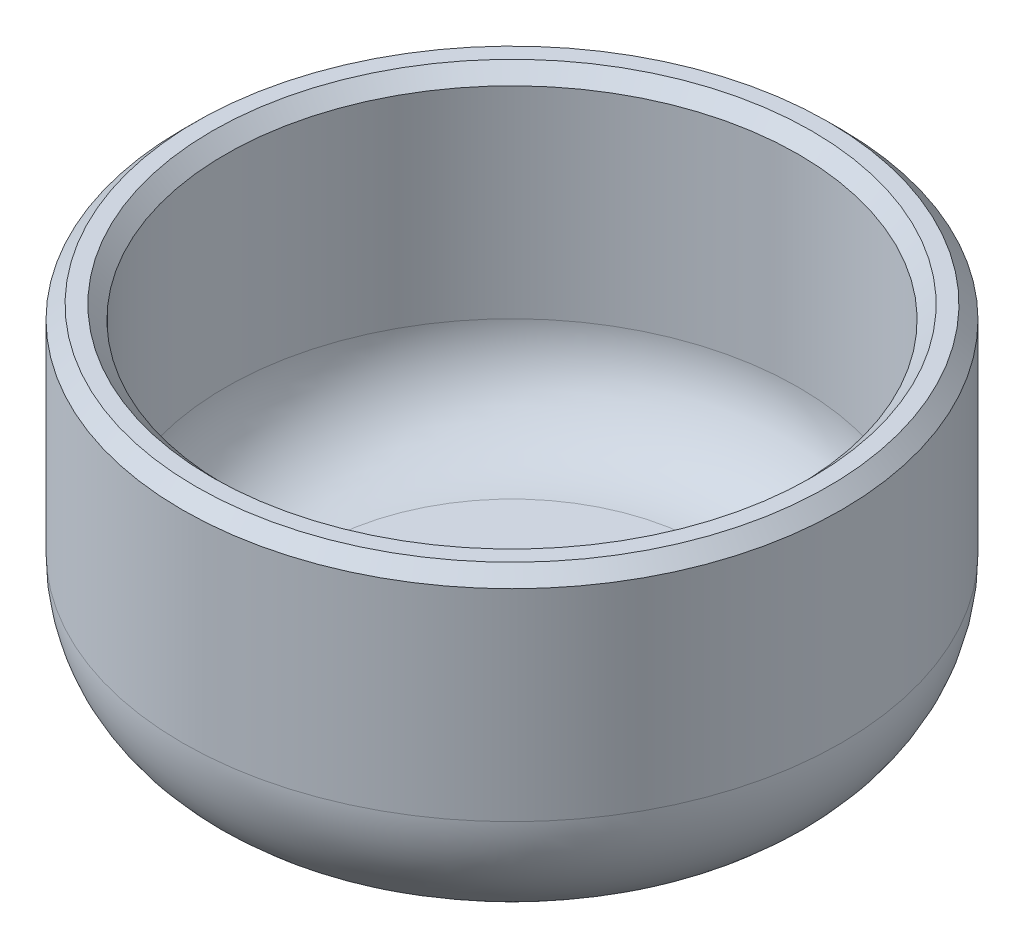
ISO-10303-21;
HEADER;
FILE_DESCRIPTION(('STEP AP214'),'2;1');
FILE_NAME('part.step','',(''),(''),'','','');
FILE_SCHEMA(('AUTOMOTIVE_DESIGN { 1 0 10303 214 1 1 1 1 }'));
ENDSEC;
DATA;
#1=APPLICATION_CONTEXT('core data for automotive mechanical design processes');
#2=APPLICATION_PROTOCOL_DEFINITION('international standard','automotive_design',2000,#1);
#3=PRODUCT_CONTEXT('',#1,'mechanical');
#4=PRODUCT('Part','Part','',(#3));
#5=PRODUCT_RELATED_PRODUCT_CATEGORY('part','',(#4));
#6=PRODUCT_DEFINITION_FORMATION('','',#4);
#7=PRODUCT_DEFINITION_CONTEXT('part definition',#1,'design');
#8=PRODUCT_DEFINITION('design','',#6,#7);
#9=PRODUCT_DEFINITION_SHAPE('','',#8);
#10=(LENGTH_UNIT() NAMED_UNIT(*) SI_UNIT(.MILLI.,.METRE.));
#11=(NAMED_UNIT(*) PLANE_ANGLE_UNIT() SI_UNIT($,.RADIAN.));
#12=(NAMED_UNIT(*) SI_UNIT($,.STERADIAN.) SOLID_ANGLE_UNIT());
#13=UNCERTAINTY_MEASURE_WITH_UNIT(LENGTH_MEASURE(1.E-05),#10,'distance_accuracy_value','');
#14=(GEOMETRIC_REPRESENTATION_CONTEXT(3) GLOBAL_UNCERTAINTY_ASSIGNED_CONTEXT((#13)) GLOBAL_UNIT_ASSIGNED_CONTEXT((#10,
#11,#12)) REPRESENTATION_CONTEXT('',''));
#15=CARTESIAN_POINT('',(0.,0.,0.));
#16=DIRECTION('',(0.,0.,1.));
#17=DIRECTION('',(1.,0.,0.));
#18=AXIS2_PLACEMENT_3D('',#15,#16,#17);
#19=CARTESIAN_POINT('',(0.,13.,0.));
#20=DIRECTION('',(0.,-1.,0.));
#21=DIRECTION('',(0.,0.,-1.));
#22=AXIS2_PLACEMENT_3D('',#19,#20,#21);
#23=CYLINDRICAL_SURFACE('',#22,12.25);
#24=CARTESIAN_POINT('',(0.,12.5,0.));
#25=DIRECTION('',(0.,1.,0.));
#26=DIRECTION('',(0.,0.,1.));
#27=AXIS2_PLACEMENT_3D('',#24,#25,#26);
#28=CIRCLE('',#27,12.25);
#29=CARTESIAN_POINT('',(0.,12.5,-12.25));
#30=VERTEX_POINT('',#29);
#31=EDGE_CURVE('E38',#30,#30,#28,.F.);
#32=CARTESIAN_POINT('',(0.,5.,0.));
#33=DIRECTION('',(0.,1.,0.));
#34=DIRECTION('',(0.,0.,1.));
#35=AXIS2_PLACEMENT_3D('',#32,#33,#34);
#36=CIRCLE('',#35,12.25);
#37=CARTESIAN_POINT('',(0.,4.99999999999999,-12.25));
#38=VERTEX_POINT('',#37);
#39=EDGE_CURVE('E54',#38,#38,#36,.T.);
#40=CARTESIAN_POINT('',(0.,12.5,-12.25));
#41=CARTESIAN_POINT('',(0.,12.421875,-12.25));
#42=CARTESIAN_POINT('',(0.,12.34375,-12.25));
#43=CARTESIAN_POINT('',(0.,12.1875,-12.25));
#44=CARTESIAN_POINT('',(0.,12.109375,-12.25));
#45=CARTESIAN_POINT('',(0.,11.953125,-12.25));
#46=CARTESIAN_POINT('',(0.,11.875,-12.25));
#47=CARTESIAN_POINT('',(0.,11.71875,-12.25));
#48=CARTESIAN_POINT('',(0.,11.640625,-12.25));
#49=CARTESIAN_POINT('',(0.,11.484375,-12.25));
#50=CARTESIAN_POINT('',(0.,11.40625,-12.25));
#51=CARTESIAN_POINT('',(0.,11.25,-12.25));
#52=CARTESIAN_POINT('',(0.,11.171875,-12.25));
#53=CARTESIAN_POINT('',(0.,11.015625,-12.25));
#54=CARTESIAN_POINT('',(0.,10.9375,-12.25));
#55=CARTESIAN_POINT('',(0.,10.78125,-12.25));
#56=CARTESIAN_POINT('',(0.,10.703125,-12.25));
#57=CARTESIAN_POINT('',(0.,10.546875,-12.25));
#58=CARTESIAN_POINT('',(0.,10.46875,-12.25));
#59=CARTESIAN_POINT('',(0.,10.3125,-12.25));
#60=CARTESIAN_POINT('',(0.,10.234375,-12.25));
#61=CARTESIAN_POINT('',(0.,10.078125,-12.25));
#62=CARTESIAN_POINT('',(0.,10.,-12.25));
#63=CARTESIAN_POINT('',(0.,9.84375000000001,-12.25));
#64=CARTESIAN_POINT('',(0.,9.76562500000001,-12.25));
#65=CARTESIAN_POINT('',(0.,9.60937500000001,-12.25));
#66=CARTESIAN_POINT('',(0.,9.53125000000001,-12.25));
#67=CARTESIAN_POINT('',(0.,9.37500000000001,-12.25));
#68=CARTESIAN_POINT('',(0.,9.29687500000001,-12.25));
#69=CARTESIAN_POINT('',(0.,9.14062500000001,-12.25));
#70=CARTESIAN_POINT('',(0.,9.06250000000001,-12.25));
#71=CARTESIAN_POINT('',(0.,8.90625000000001,-12.25));
#72=CARTESIAN_POINT('',(0.,8.828125,-12.25));
#73=CARTESIAN_POINT('',(0.,8.671875,-12.25));
#74=CARTESIAN_POINT('',(0.,8.59375000000001,-12.25));
#75=CARTESIAN_POINT('',(0.,8.43750000000001,-12.25));
#76=CARTESIAN_POINT('',(0.,8.359375,-12.25));
#77=CARTESIAN_POINT('',(0.,8.203125,-12.25));
#78=CARTESIAN_POINT('',(0.,8.125,-12.25));
#79=CARTESIAN_POINT('',(0.,7.96875,-12.25));
#80=CARTESIAN_POINT('',(0.,7.890625,-12.25));
#81=CARTESIAN_POINT('',(0.,7.734375,-12.25));
#82=CARTESIAN_POINT('',(0.,7.65625,-12.25));
#83=CARTESIAN_POINT('',(0.,7.5,-12.25));
#84=CARTESIAN_POINT('',(0.,7.421875,-12.25));
#85=CARTESIAN_POINT('',(0.,7.265625,-12.25));
#86=CARTESIAN_POINT('',(0.,7.1875,-12.25));
#87=CARTESIAN_POINT('',(0.,7.03125,-12.25));
#88=CARTESIAN_POINT('',(0.,6.953125,-12.25));
#89=CARTESIAN_POINT('',(0.,6.796875,-12.25));
#90=CARTESIAN_POINT('',(0.,6.71875,-12.25));
#91=CARTESIAN_POINT('',(0.,6.5625,-12.25));
#92=CARTESIAN_POINT('',(0.,6.484375,-12.25));
#93=CARTESIAN_POINT('',(0.,6.328125,-12.25));
#94=CARTESIAN_POINT('',(0.,6.25,-12.25));
#95=CARTESIAN_POINT('',(0.,6.09375,-12.25));
#96=CARTESIAN_POINT('',(0.,6.015625,-12.25));
#97=CARTESIAN_POINT('',(0.,5.859375,-12.25));
#98=CARTESIAN_POINT('',(0.,5.78125,-12.25));
#99=CARTESIAN_POINT('',(0.,5.625,-12.25));
#100=CARTESIAN_POINT('',(0.,5.54687499999999,-12.25));
#101=CARTESIAN_POINT('',(0.,5.39062499999999,-12.25));
#102=CARTESIAN_POINT('',(0.,5.31249999999999,-12.25));
#103=CARTESIAN_POINT('',(0.,5.15624999999999,-12.25));
#104=CARTESIAN_POINT('',(0.,5.07812499999999,-12.25));
#105=CARTESIAN_POINT('',(0.,4.99999999999999,-12.25));
#106=B_SPLINE_CURVE_WITH_KNOTS('',3,(#40,#41,#42,#43,#44,#45,#46,#47,#48,#49,#50,#51,#52,#53,
#54,#55,#56,#57,#58,#59,#60,#61,#62,#63,#64,#65,#66,#67,#68,#69,#70,#71,#72,#73,#74,#75,#76,#77,
#78,#79,#80,#81,#82,#83,#84,#85,#86,#87,#88,#89,#90,#91,#92,#93,#94,#95,#96,#97,#98,#99,#100,
#101,#102,#103,#104,#105),.UNSPECIFIED.,.F.,.F.,(4,2,2,2,2,2,2,2,2,2,2,2,2,2,2,2,2,2,2,2,2,2,2,
2,2,2,2,2,2,2,2,2,4),(0.,0.234375,0.46875,0.703125000000001,0.937500000000003,1.171875,1.40625,
1.640625,1.87500000000001,2.10937500000001,2.34375000000001,2.57812500000001,2.81250000000001,
3.04687500000001,3.28125000000001,3.51562500000001,3.75000000000001,3.98437500000001,
4.21875000000001,4.45312500000001,4.68750000000001,4.92187500000002,5.15625000000002,
5.39062500000002,5.62500000000002,5.85937500000002,6.09375000000002,6.32812500000002,
6.56250000000002,6.79687500000002,7.03125000000002,7.26562500000002,7.50000000000002),.UNSPECIFIED.);
#107=EDGE_CURVE('BSEAM31',#30,#38,#106,.T.);
#108=ORIENTED_EDGE('',*,*,#31,.T.);
#109=ORIENTED_EDGE('',*,*,#39,.T.);
#110=ORIENTED_EDGE('',*,*,#107,.T.);
#111=ORIENTED_EDGE('',*,*,#107,.F.);
#112=EDGE_LOOP('',(#108,#110,#109,#111));
#113=FACE_BOUND('',#112,.T.);
#114=ADVANCED_FACE('F31',(#113),#23,.T.);
#115=CARTESIAN_POINT('',(0.,13.,0.));
#116=DIRECTION('',(0.,1.,0.));
#117=DIRECTION('',(0.,0.,1.));
#118=AXIS2_PLACEMENT_3D('',#115,#116,#117);
#119=PLANE('',#118);
#120=CARTESIAN_POINT('',(0.,13.,0.));
#121=DIRECTION('',(0.,1.,0.));
#122=DIRECTION('',(0.,0.,1.));
#123=AXIS2_PLACEMENT_3D('',#120,#121,#122);
#124=CIRCLE('',#123,11.75);
#125=CARTESIAN_POINT('',(0.,13.,11.75));
#126=VERTEX_POINT('',#125);
#127=EDGE_CURVE('E42',#126,#126,#124,.T.);
#128=ORIENTED_EDGE('',*,*,#127,.T.);
#129=EDGE_LOOP('',(#128));
#130=FACE_BOUND('',#129,.T.);
#131=CARTESIAN_POINT('',(0.,13.,0.));
#132=DIRECTION('',(0.,1.,0.));
#133=DIRECTION('',(0.,0.,1.));
#134=AXIS2_PLACEMENT_3D('',#131,#132,#133);
#135=CIRCLE('',#134,11.15);
#136=CARTESIAN_POINT('',(0.,13.,11.15));
#137=VERTEX_POINT('',#136);
#138=EDGE_CURVE('E46',#137,#137,#135,.F.);
#139=ORIENTED_EDGE('',*,*,#138,.T.);
#140=EDGE_LOOP('',(#139));
#141=FACE_BOUND('',#140,.T.);
#142=ADVANCED_FACE('F81',(#130,#141),#119,.T.);
#143=CARTESIAN_POINT('',(0.,0.,0.));
#144=DIRECTION('',(0.,1.,0.));
#145=DIRECTION('',(0.,0.,1.));
#146=AXIS2_PLACEMENT_3D('',#143,#144,#145);
#147=PLANE('',#146);
#148=CARTESIAN_POINT('',(0.,0.,0.));
#149=DIRECTION('',(0.,1.,0.));
#150=DIRECTION('',(0.,0.,1.));
#151=AXIS2_PLACEMENT_3D('',#148,#149,#150);
#152=CIRCLE('',#151,7.25);
#153=CARTESIAN_POINT('',(0.,0.,7.25));
#154=VERTEX_POINT('',#153);
#155=EDGE_CURVE('E51',#154,#154,#152,.F.);
#156=ORIENTED_EDGE('',*,*,#155,.T.);
#157=EDGE_LOOP('',(#156));
#158=FACE_BOUND('',#157,.T.);
#159=ADVANCED_FACE('F77',(#158),#147,.F.);
#160=CARTESIAN_POINT('',(0.,5.,0.));
#161=DIRECTION('',(0.,1.,0.));
#162=DIRECTION('',(0.,0.,1.));
#163=AXIS2_PLACEMENT_3D('',#160,#161,#162);
#164=TOROIDAL_SURFACE('',#163,7.25,5.);
#165=ORIENTED_EDGE('',*,*,#155,.F.);
#166=EDGE_LOOP('',(#165));
#167=FACE_BOUND('',#166,.T.);
#168=ORIENTED_EDGE('',*,*,#39,.F.);
#169=EDGE_LOOP('',(#168));
#170=FACE_BOUND('',#169,.T.);
#171=ADVANCED_FACE('F69',(#167,#170),#164,.T.);
#172=CARTESIAN_POINT('',(0.,13.,0.));
#173=DIRECTION('',(0.,-1.,0.));
#174=DIRECTION('',(0.,0.,-1.));
#175=AXIS2_PLACEMENT_3D('',#172,#173,#174);
#176=CYLINDRICAL_SURFACE('',#175,10.65);
#177=CARTESIAN_POINT('',(0.,12.5,0.));
#178=DIRECTION('',(0.,1.,0.));
#179=DIRECTION('',(0.,0.,1.));
#180=AXIS2_PLACEMENT_3D('',#177,#178,#179);
#181=CIRCLE('',#180,10.65);
#182=CARTESIAN_POINT('',(0.,12.5,-10.65));
#183=VERTEX_POINT('',#182);
#184=EDGE_CURVE('E10',#183,#183,#181,.T.);
#185=CARTESIAN_POINT('',(0.,5.,0.));
#186=DIRECTION('',(0.,-1.,0.));
#187=DIRECTION('',(0.,0.,-1.));
#188=AXIS2_PLACEMENT_3D('',#185,#186,#187);
#189=CIRCLE('',#188,10.65);
#190=CARTESIAN_POINT('',(0.,5.,-10.65));
#191=VERTEX_POINT('',#190);
#192=EDGE_CURVE('E60',#191,#191,#189,.F.);
#193=CARTESIAN_POINT('',(0.,12.5,-10.65));
#194=CARTESIAN_POINT('',(0.,12.421875,-10.65));
#195=CARTESIAN_POINT('',(0.,12.34375,-10.65));
#196=CARTESIAN_POINT('',(0.,12.1875,-10.65));
#197=CARTESIAN_POINT('',(0.,12.109375,-10.65));
#198=CARTESIAN_POINT('',(0.,11.953125,-10.65));
#199=CARTESIAN_POINT('',(0.,11.875,-10.65));
#200=CARTESIAN_POINT('',(0.,11.71875,-10.65));
#201=CARTESIAN_POINT('',(0.,11.640625,-10.65));
#202=CARTESIAN_POINT('',(0.,11.484375,-10.65));
#203=CARTESIAN_POINT('',(0.,11.40625,-10.65));
#204=CARTESIAN_POINT('',(0.,11.25,-10.65));
#205=CARTESIAN_POINT('',(0.,11.171875,-10.65));
#206=CARTESIAN_POINT('',(0.,11.015625,-10.65));
#207=CARTESIAN_POINT('',(0.,10.9375,-10.65));
#208=CARTESIAN_POINT('',(0.,10.78125,-10.65));
#209=CARTESIAN_POINT('',(0.,10.703125,-10.65));
#210=CARTESIAN_POINT('',(0.,10.546875,-10.65));
#211=CARTESIAN_POINT('',(0.,10.46875,-10.65));
#212=CARTESIAN_POINT('',(0.,10.3125,-10.65));
#213=CARTESIAN_POINT('',(0.,10.234375,-10.65));
#214=CARTESIAN_POINT('',(0.,10.078125,-10.65));
#215=CARTESIAN_POINT('',(0.,9.99999999999999,-10.65));
#216=CARTESIAN_POINT('',(0.,9.84374999999999,-10.65));
#217=CARTESIAN_POINT('',(0.,9.76562499999999,-10.65));
#218=CARTESIAN_POINT('',(0.,9.60937499999999,-10.65));
#219=CARTESIAN_POINT('',(0.,9.53124999999999,-10.65));
#220=CARTESIAN_POINT('',(0.,9.37499999999999,-10.65));
#221=CARTESIAN_POINT('',(0.,9.29687499999999,-10.65));
#222=CARTESIAN_POINT('',(0.,9.14062499999999,-10.65));
#223=CARTESIAN_POINT('',(0.,9.06249999999999,-10.65));
#224=CARTESIAN_POINT('',(0.,8.90624999999999,-10.65));
#225=CARTESIAN_POINT('',(0.,8.82812499999999,-10.65));
#226=CARTESIAN_POINT('',(0.,8.67187499999999,-10.65));
#227=CARTESIAN_POINT('',(0.,8.59374999999999,-10.65));
#228=CARTESIAN_POINT('',(0.,8.43749999999999,-10.65));
#229=CARTESIAN_POINT('',(0.,8.35937499999999,-10.65));
#230=CARTESIAN_POINT('',(0.,8.20312499999999,-10.65));
#231=CARTESIAN_POINT('',(0.,8.12499999999999,-10.65));
#232=CARTESIAN_POINT('',(0.,7.96874999999999,-10.65));
#233=CARTESIAN_POINT('',(0.,7.89062499999999,-10.65));
#234=CARTESIAN_POINT('',(0.,7.73437499999999,-10.65));
#235=CARTESIAN_POINT('',(0.,7.65624999999999,-10.65));
#236=CARTESIAN_POINT('',(0.,7.49999999999999,-10.65));
#237=CARTESIAN_POINT('',(0.,7.42187499999999,-10.65));
#238=CARTESIAN_POINT('',(0.,7.26562499999999,-10.65));
#239=CARTESIAN_POINT('',(0.,7.18749999999999,-10.65));
#240=CARTESIAN_POINT('',(0.,7.03124999999999,-10.65));
#241=CARTESIAN_POINT('',(0.,6.95312499999999,-10.65));
#242=CARTESIAN_POINT('',(0.,6.79687499999999,-10.65));
#243=CARTESIAN_POINT('',(0.,6.71875,-10.65));
#244=CARTESIAN_POINT('',(0.,6.5625,-10.65));
#245=CARTESIAN_POINT('',(0.,6.484375,-10.65));
#246=CARTESIAN_POINT('',(0.,6.328125,-10.65));
#247=CARTESIAN_POINT('',(0.,6.25,-10.65));
#248=CARTESIAN_POINT('',(0.,6.09375,-10.65));
#249=CARTESIAN_POINT('',(0.,6.015625,-10.65));
#250=CARTESIAN_POINT('',(0.,5.859375,-10.65));
#251=CARTESIAN_POINT('',(0.,5.78125,-10.65));
#252=CARTESIAN_POINT('',(0.,5.625,-10.65));
#253=CARTESIAN_POINT('',(0.,5.546875,-10.65));
#254=CARTESIAN_POINT('',(0.,5.390625,-10.65));
#255=CARTESIAN_POINT('',(0.,5.3125,-10.65));
#256=CARTESIAN_POINT('',(0.,5.15625,-10.65));
#257=CARTESIAN_POINT('',(0.,5.078125,-10.65));
#258=CARTESIAN_POINT('',(0.,5.,-10.65));
#259=B_SPLINE_CURVE_WITH_KNOTS('',3,(#193,#194,#195,#196,#197,#198,#199,#200,#201,#202,#203,
#204,#205,#206,#207,#208,#209,#210,#211,#212,#213,#214,#215,#216,#217,#218,#219,#220,#221,#222,
#223,#224,#225,#226,#227,#228,#229,#230,#231,#232,#233,#234,#235,#236,#237,#238,#239,#240,#241,
#242,#243,#244,#245,#246,#247,#248,#249,#250,#251,#252,#253,#254,#255,#256,#257,#258),
.UNSPECIFIED.,.F.,.F.,(4,2,2,2,2,2,2,2,2,2,2,2,2,2,2,2,2,2,2,2,2,2,2,2,2,2,2,2,2,2,2,2,4),(0.,
0.234375,0.468749999999999,0.703124999999999,0.937499999999997,1.171875,1.40625,1.640625,
1.87499999999999,2.109375,2.34374999999999,2.57812499999999,2.81249999999999,3.04687499999999,
3.28124999999999,3.51562499999999,3.74999999999999,3.98437499999999,4.21874999999999,
4.45312499999999,4.68749999999999,4.92187499999998,5.15624999999998,5.39062499999998,
5.62499999999998,5.85937499999998,6.09374999999998,6.32812499999998,6.56249999999998,
6.79687499999998,7.03124999999998,7.26562499999998,7.49999999999998),.UNSPECIFIED.);
#260=EDGE_CURVE('BSEAM66',#183,#191,#259,.T.);
#261=ORIENTED_EDGE('',*,*,#184,.T.);
#262=ORIENTED_EDGE('',*,*,#192,.F.);
#263=ORIENTED_EDGE('',*,*,#260,.T.);
#264=ORIENTED_EDGE('',*,*,#260,.F.);
#265=EDGE_LOOP('',(#261,#263,#262,#264));
#266=FACE_BOUND('',#265,.T.);
#267=ADVANCED_FACE('F66',(#266),#176,.F.);
#268=CARTESIAN_POINT('',(0.,1.6,0.));
#269=DIRECTION('',(0.,1.,0.));
#270=DIRECTION('',(0.,0.,1.));
#271=AXIS2_PLACEMENT_3D('',#268,#269,#270);
#272=PLANE('',#271);
#273=CARTESIAN_POINT('',(0.,1.6,0.));
#274=DIRECTION('',(0.,1.,0.));
#275=DIRECTION('',(0.,0.,1.));
#276=AXIS2_PLACEMENT_3D('',#273,#274,#275);
#277=CIRCLE('',#276,7.25);
#278=CARTESIAN_POINT('',(0.,1.6,7.25));
#279=VERTEX_POINT('',#278);
#280=EDGE_CURVE('E57',#279,#279,#277,.F.);
#281=ORIENTED_EDGE('',*,*,#280,.F.);
#282=EDGE_LOOP('',(#281));
#283=FACE_BOUND('',#282,.T.);
#284=ADVANCED_FACE('F68',(#283),#272,.T.);
#285=CARTESIAN_POINT('',(0.,5.,0.));
#286=DIRECTION('',(0.,1.,0.));
#287=DIRECTION('',(0.,0.,1.));
#288=AXIS2_PLACEMENT_3D('',#285,#286,#287);
#289=TOROIDAL_SURFACE('',#288,7.25,3.4);
#290=ORIENTED_EDGE('',*,*,#280,.T.);
#291=EDGE_LOOP('',(#290));
#292=FACE_BOUND('',#291,.T.);
#293=ORIENTED_EDGE('',*,*,#192,.T.);
#294=EDGE_LOOP('',(#293));
#295=FACE_BOUND('',#294,.T.);
#296=ADVANCED_FACE('F64',(#292,#295),#289,.F.);
#297=CARTESIAN_POINT('',(0.,13.,0.));
#298=DIRECTION('',(0.,-1.,0.));
#299=DIRECTION('',(0.,0.,-1.));
#300=AXIS2_PLACEMENT_3D('',#297,#298,#299);
#301=CONICAL_SURFACE('',#300,11.75,0.785398163397445);
#302=ORIENTED_EDGE('',*,*,#31,.F.);
#303=EDGE_LOOP('',(#302));
#304=FACE_BOUND('',#303,.T.);
#305=ORIENTED_EDGE('',*,*,#127,.F.);
#306=EDGE_LOOP('',(#305));
#307=FACE_BOUND('',#306,.T.);
#308=ADVANCED_FACE('F90',(#304,#307),#301,.T.);
#309=CARTESIAN_POINT('',(0.,12.5,0.));
#310=DIRECTION('',(0.,1.,0.));
#311=DIRECTION('',(0.,0.,1.));
#312=AXIS2_PLACEMENT_3D('',#309,#310,#311);
#313=CONICAL_SURFACE('',#312,10.65,0.785398163397447);
#314=ORIENTED_EDGE('',*,*,#138,.F.);
#315=EDGE_LOOP('',(#314));
#316=FACE_BOUND('',#315,.T.);
#317=ORIENTED_EDGE('',*,*,#184,.F.);
#318=EDGE_LOOP('',(#317));
#319=FACE_BOUND('',#318,.T.);
#320=ADVANCED_FACE('F33',(#316,#319),#313,.F.);
#321=CLOSED_SHELL('',(#114,#142,#159,#171,#267,#284,#296,#308,#320));
#322=MANIFOLD_SOLID_BREP('B2',#321);
#323=ADVANCED_BREP_SHAPE_REPRESENTATION('',(#18,#322),#14);
#324=SHAPE_DEFINITION_REPRESENTATION(#9,#323);
ENDSEC;
END-ISO-10303-21;
